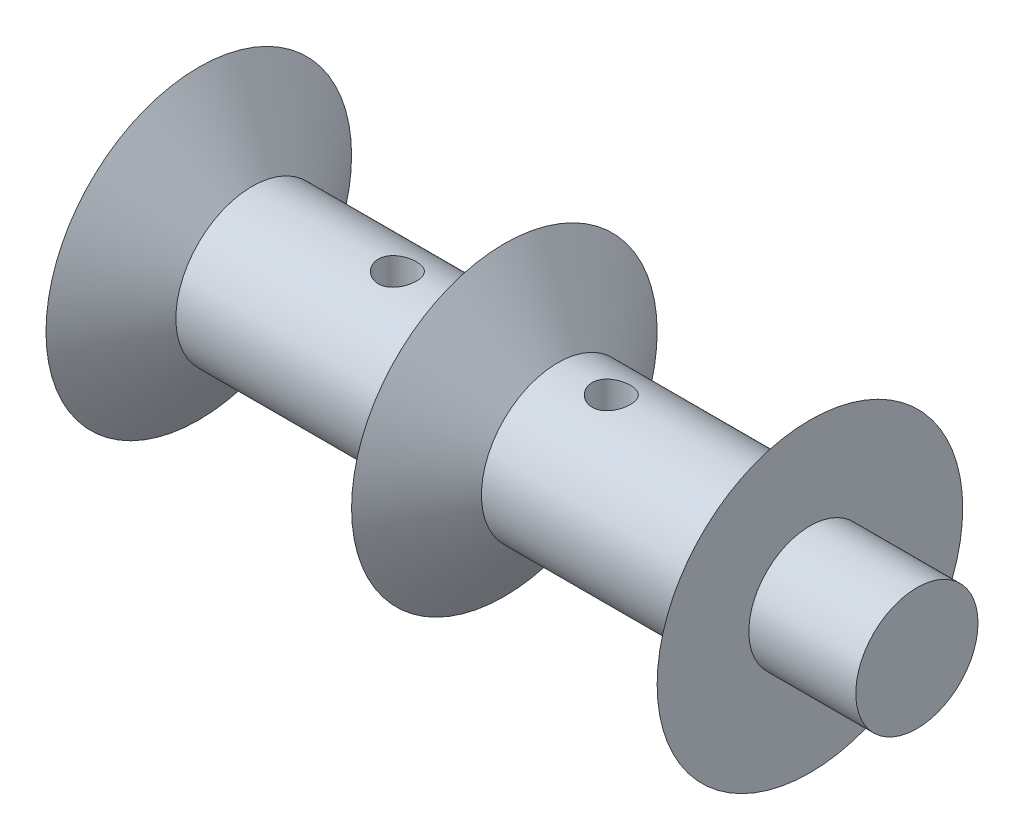
ISO-10303-21;
HEADER;
FILE_DESCRIPTION(('STEP AP214'),'2;1');
FILE_NAME('part.step','',(''),(''),'','','');
FILE_SCHEMA(('AUTOMOTIVE_DESIGN { 1 0 10303 214 1 1 1 1 }'));
ENDSEC;
DATA;
#1=APPLICATION_CONTEXT('core data for automotive mechanical design processes');
#2=APPLICATION_PROTOCOL_DEFINITION('international standard','automotive_design',2000,#1);
#3=PRODUCT_CONTEXT('',#1,'mechanical');
#4=PRODUCT('Part','Part','',(#3));
#5=PRODUCT_RELATED_PRODUCT_CATEGORY('part','',(#4));
#6=PRODUCT_DEFINITION_FORMATION('','',#4);
#7=PRODUCT_DEFINITION_CONTEXT('part definition',#1,'design');
#8=PRODUCT_DEFINITION('design','',#6,#7);
#9=PRODUCT_DEFINITION_SHAPE('','',#8);
#10=(LENGTH_UNIT() NAMED_UNIT(*) SI_UNIT(.MILLI.,.METRE.));
#11=(NAMED_UNIT(*) PLANE_ANGLE_UNIT() SI_UNIT($,.RADIAN.));
#12=(NAMED_UNIT(*) SI_UNIT($,.STERADIAN.) SOLID_ANGLE_UNIT());
#13=UNCERTAINTY_MEASURE_WITH_UNIT(LENGTH_MEASURE(1.E-05),#10,'distance_accuracy_value','');
#14=(GEOMETRIC_REPRESENTATION_CONTEXT(3) GLOBAL_UNCERTAINTY_ASSIGNED_CONTEXT((#13)) GLOBAL_UNIT_ASSIGNED_CONTEXT((#10,
#11,#12)) REPRESENTATION_CONTEXT('',''));
#15=CARTESIAN_POINT('',(0.,0.,0.));
#16=DIRECTION('',(0.,0.,1.));
#17=DIRECTION('',(1.,0.,0.));
#18=AXIS2_PLACEMENT_3D('',#15,#16,#17);
#19=CARTESIAN_POINT('',(-11.,0.,1.5));
#20=DIRECTION('',(0.,0.,-1.));
#21=DIRECTION('',(-1.,0.,0.));
#22=AXIS2_PLACEMENT_3D('',#19,#20,#21);
#23=PLANE('',#22);
#24=DIRECTION('',(-1.,0.,0.));
#25=VECTOR('',#24,1.);
#26=CARTESIAN_POINT('',(-11.,-2.,1.5));
#27=LINE('',#26,#25);
#28=CARTESIAN_POINT('',(-11.,-2.,1.5));
#29=VERTEX_POINT('',#28);
#30=CARTESIAN_POINT('',(-17.5,-2.,1.5));
#31=VERTEX_POINT('',#30);
#32=EDGE_CURVE('E110',#29,#31,#27,.T.);
#33=ORIENTED_EDGE('',*,*,#32,.T.);
#34=DIRECTION('',(0.,1.,0.));
#35=VECTOR('',#34,1.);
#36=CARTESIAN_POINT('',(-17.5,0.,1.5));
#37=LINE('',#36,#35);
#38=CARTESIAN_POINT('',(-17.5,2.,1.5));
#39=VERTEX_POINT('',#38);
#40=EDGE_CURVE('E94',#31,#39,#37,.T.);
#41=ORIENTED_EDGE('',*,*,#40,.T.);
#42=DIRECTION('',(-1.,0.,0.));
#43=VECTOR('',#42,1.);
#44=CARTESIAN_POINT('',(-11.,2.,1.5));
#45=LINE('',#44,#43);
#46=CARTESIAN_POINT('',(-11.,2.,1.5));
#47=VERTEX_POINT('',#46);
#48=EDGE_CURVE('E108',#47,#39,#45,.T.);
#49=ORIENTED_EDGE('',*,*,#48,.F.);
#50=DIRECTION('',(0.,-1.,0.));
#51=VECTOR('',#50,1.);
#52=CARTESIAN_POINT('',(-11.,0.,1.5));
#53=LINE('',#52,#51);
#54=EDGE_CURVE('E235',#47,#29,#53,.T.);
#55=ORIENTED_EDGE('',*,*,#54,.T.);
#56=EDGE_LOOP('',(#33,#41,#49,#55));
#57=FACE_BOUND('',#56,.T.);
#58=ADVANCED_FACE('F45',(#57),#23,.T.);
#59=CARTESIAN_POINT('',(-11.,0.,-1.5));
#60=DIRECTION('',(0.,0.,-1.));
#61=DIRECTION('',(-1.,0.,0.));
#62=AXIS2_PLACEMENT_3D('',#59,#60,#61);
#63=PLANE('',#62);
#64=DIRECTION('',(0.,1.,0.));
#65=VECTOR('',#64,1.);
#66=CARTESIAN_POINT('',(-17.5,0.,-1.5));
#67=LINE('',#66,#65);
#68=CARTESIAN_POINT('',(-17.5,-2.,-1.5));
#69=VERTEX_POINT('',#68);
#70=CARTESIAN_POINT('',(-17.5,2.,-1.5));
#71=VERTEX_POINT('',#70);
#72=EDGE_CURVE('E89',#69,#71,#67,.T.);
#73=ORIENTED_EDGE('',*,*,#72,.F.);
#74=DIRECTION('',(-1.,0.,0.));
#75=VECTOR('',#74,1.);
#76=CARTESIAN_POINT('',(-11.,-2.,-1.5));
#77=LINE('',#76,#75);
#78=CARTESIAN_POINT('',(-11.,-2.,-1.5));
#79=VERTEX_POINT('',#78);
#80=EDGE_CURVE('E102',#79,#69,#77,.T.);
#81=ORIENTED_EDGE('',*,*,#80,.F.);
#82=DIRECTION('',(0.,-1.,0.));
#83=VECTOR('',#82,1.);
#84=CARTESIAN_POINT('',(-11.,0.,-1.5));
#85=LINE('',#84,#83);
#86=CARTESIAN_POINT('',(-11.,2.,-1.5));
#87=VERTEX_POINT('',#86);
#88=EDGE_CURVE('E106',#87,#79,#85,.T.);
#89=ORIENTED_EDGE('',*,*,#88,.F.);
#90=DIRECTION('',(-1.,0.,0.));
#91=VECTOR('',#90,1.);
#92=CARTESIAN_POINT('',(-11.,2.,-1.5));
#93=LINE('',#92,#91);
#94=EDGE_CURVE('E99',#87,#71,#93,.T.);
#95=ORIENTED_EDGE('',*,*,#94,.T.);
#96=EDGE_LOOP('',(#73,#81,#89,#95));
#97=FACE_BOUND('',#96,.T.);
#98=ADVANCED_FACE('F104',(#97),#63,.F.);
#99=CARTESIAN_POINT('',(-20.,9.99999999999999,0.));
#100=DIRECTION('',(-1.,0.,0.));
#101=DIRECTION('',(0.,0.,1.));
#102=AXIS2_PLACEMENT_3D('',#99,#100,#101);
#103=PLANE('',#102);
#104=CARTESIAN_POINT('',(-20.,0.,0.));
#105=DIRECTION('',(-1.,0.,0.));
#106=DIRECTION('',(0.,0.,1.));
#107=AXIS2_PLACEMENT_3D('',#104,#105,#106);
#108=CIRCLE('',#107,2.5);
#109=CARTESIAN_POINT('',(-20.,0.,2.5));
#110=VERTEX_POINT('',#109);
#111=EDGE_CURVE('E234',#110,#110,#108,.T.);
#112=ORIENTED_EDGE('',*,*,#111,.F.);
#113=EDGE_LOOP('',(#112));
#114=FACE_BOUND('',#113,.T.);
#115=CARTESIAN_POINT('',(-20.,0.,0.));
#116=DIRECTION('',(1.,0.,0.));
#117=DIRECTION('',(0.,0.,-1.));
#118=AXIS2_PLACEMENT_3D('',#115,#116,#117);
#119=CIRCLE('',#118,10.);
#120=CARTESIAN_POINT('',(-20.,0.,-10.));
#121=VERTEX_POINT('',#120);
#122=EDGE_CURVE('E120',#121,#121,#119,.T.);
#123=ORIENTED_EDGE('',*,*,#122,.F.);
#124=EDGE_LOOP('',(#123));
#125=FACE_BOUND('',#124,.T.);
#126=ADVANCED_FACE('F180',(#114,#125),#103,.T.);
#127=CARTESIAN_POINT('',(20.,0.,0.));
#128=DIRECTION('',(1.,0.,0.));
#129=DIRECTION('',(0.,0.,-1.));
#130=AXIS2_PLACEMENT_3D('',#127,#128,#129);
#131=CYLINDRICAL_SURFACE('',#130,5.);
#132=CARTESIAN_POINT('',(-7.,-4.84122918275927,1.25));
#133=CARTESIAN_POINT('',(-7.0690253754623,-4.84123050042654,1.24999803929589));
#134=CARTESIAN_POINT('',(-7.138072449339,-4.84272153006957,1.24426312274865));
#135=CARTESIAN_POINT('',(-7.27418378908702,-4.84850930996624,1.22151156273207));
#136=CARTESIAN_POINT('',(-7.34124687723416,-4.85280769310907,1.2044883533711));
#137=CARTESIAN_POINT('',(-7.47140176909352,-4.86369362297984,1.15974559981597));
#138=CARTESIAN_POINT('',(-7.53449857769283,-4.87027821345204,1.13203986392723));
#139=CARTESIAN_POINT('',(-7.65515542626996,-4.88499096014404,1.0667605706307));
#140=CARTESIAN_POINT('',(-7.71271523104011,-4.89311918189251,1.02918659428035));
#141=CARTESIAN_POINT('',(-7.8219308226311,-4.91020358177806,0.944354213655937));
#142=CARTESIAN_POINT('',(-7.87344680017502,-4.91917298811515,0.896918443852024));
#143=CARTESIAN_POINT('',(-7.96788069718017,-4.93681437757649,0.794091032050333));
#144=CARTESIAN_POINT('',(-8.01079781281087,-4.94548633283195,0.738698647090154));
#145=CARTESIAN_POINT('',(-8.08738773381564,-4.96170207760291,0.620572600539477));
#146=CARTESIAN_POINT('',(-8.12092319408073,-4.96922843700296,0.55774728809756));
#147=CARTESIAN_POINT('',(-8.17690482207654,-4.98215405962992,0.427131592146381));
#148=CARTESIAN_POINT('',(-8.19935262595776,-4.98755363667172,0.35934194289597));
#149=CARTESIAN_POINT('',(-8.23207391728929,-4.9955237942409,0.22217937937708));
#150=CARTESIAN_POINT('',(-8.24258482216329,-4.99814946922157,0.152866359774487));
#151=CARTESIAN_POINT('',(-8.25187918963778,-5.00046797053649,0.0134144096313842));
#152=CARTESIAN_POINT('',(-8.2506643861048,-5.00016123048352,-0.0567243972690347));
#153=CARTESIAN_POINT('',(-8.23671257487493,-4.99669047476767,-0.194190308965485));
#154=CARTESIAN_POINT('',(-8.22423183747307,-4.99359001170437,-0.261545269501334));
#155=CARTESIAN_POINT('',(-8.18851436497575,-4.98495418262427,-0.393172809267108));
#156=CARTESIAN_POINT('',(-8.16527705731129,-4.9794186869922,-0.457445224213048));
#157=CARTESIAN_POINT('',(-8.10849871465647,-4.96643754850448,-0.581758379377259));
#158=CARTESIAN_POINT('',(-8.07486647766912,-4.95897509847527,-0.641755637208131));
#159=CARTESIAN_POINT('',(-7.99832216044187,-4.94294951904825,-0.755344527925612));
#160=CARTESIAN_POINT('',(-7.95540846571969,-4.93438619826245,-0.808935043856882));
#161=CARTESIAN_POINT('',(-7.86014562900881,-4.9168185688476,-0.909717543856195));
#162=CARTESIAN_POINT('',(-7.80757255382611,-4.90780859762959,-0.956697098843999));
#163=CARTESIAN_POINT('',(-7.69520001322987,-4.89057521758353,-1.04122046995377));
#164=CARTESIAN_POINT('',(-7.6354002102545,-4.88235184552985,-1.07876384505752));
#165=CARTESIAN_POINT('',(-7.50985498292552,-4.86760248415824,-1.14348516127825));
#166=CARTESIAN_POINT('',(-7.4440821348434,-4.8610849186286,-1.17061195871311));
#167=CARTESIAN_POINT('',(-7.30870726596177,-4.85059320069979,-1.21335702579542));
#168=CARTESIAN_POINT('',(-7.23910606800843,-4.84661850405109,-1.22897775819114));
#169=CARTESIAN_POINT('',(-7.10002024923844,-4.8417767801957,-1.24791481933259));
#170=CARTESIAN_POINT('',(-7.03058110333519,-4.84083044546824,-1.25154523695981));
#171=CARTESIAN_POINT('',(-6.89208903171092,-4.8419367174052,-1.24725849525777));
#172=CARTESIAN_POINT('',(-6.82303607102438,-4.84398904800633,-1.2393423989244));
#173=CARTESIAN_POINT('',(-6.68844286752265,-4.8507854097728,-1.21246273196883));
#174=CARTESIAN_POINT('',(-6.62286363671458,-4.85548485117188,-1.19368203414087));
#175=CARTESIAN_POINT('',(-6.49578427107416,-4.86700359135481,-1.14580904083531));
#176=CARTESIAN_POINT('',(-6.43428462047233,-4.87382314124307,-1.11671552385627));
#177=CARTESIAN_POINT('',(-6.31577936106633,-4.88898068546631,-1.04838533396828));
#178=CARTESIAN_POINT('',(-6.25888557997845,-4.89734584303321,-1.00896087691781));
#179=CARTESIAN_POINT('',(-6.15240581859932,-4.91458541535858,-0.921325366168069));
#180=CARTESIAN_POINT('',(-6.10282104167496,-4.92345991364235,-0.873112868506799));
#181=CARTESIAN_POINT('',(-6.01109447871452,-4.94098701515803,-0.767828401230907));
#182=CARTESIAN_POINT('',(-5.96916996872559,-4.94962851030918,-0.71056494066449));
#183=CARTESIAN_POINT('',(-5.89553206652438,-4.96548608306867,-0.589628353368344));
#184=CARTESIAN_POINT('',(-5.8638181416959,-4.9727022350198,-0.525955561196988));
#185=CARTESIAN_POINT('',(-5.81177698273603,-4.98485057869157,-0.394447752163862));
#186=CARTESIAN_POINT('',(-5.79136785781047,-4.98979915011205,-0.326646726284851));
#187=CARTESIAN_POINT('',(-5.76226983269579,-4.99692646697894,-0.18843720039851));
#188=CARTESIAN_POINT('',(-5.75357867063047,-4.99910574696704,-0.118029206301554));
#189=CARTESIAN_POINT('',(-5.74829051303058,-5.00042711761014,0.021354408054158));
#190=CARTESIAN_POINT('',(-5.75137286363076,-4.99964973600011,0.0903172837075413));
#191=CARTESIAN_POINT('',(-5.76880978411792,-4.9953237057178,0.226709370518424));
#192=CARTESIAN_POINT('',(-5.78316401876638,-4.99177513946369,0.294138627226108));
#193=CARTESIAN_POINT('',(-5.82256527471366,-4.98231791067453,0.42521379455602));
#194=CARTESIAN_POINT('',(-5.84755431664328,-4.97642205628333,0.488878118226273));
#195=CARTESIAN_POINT('',(-5.90746322377416,-4.9628911114173,0.611146316301835));
#196=CARTESIAN_POINT('',(-5.94238434083696,-4.9552558017217,0.669749551581314));
#197=CARTESIAN_POINT('',(-6.02214404249634,-4.93884062101666,0.781752410529874));
#198=CARTESIAN_POINT('',(-6.06720017863422,-4.93003771182014,0.83499373537573));
#199=CARTESIAN_POINT('',(-6.16552856496725,-4.91238311316553,0.933268775339068));
#200=CARTESIAN_POINT('',(-6.21880289512238,-4.90353141190695,0.978300406335236));
#201=CARTESIAN_POINT('',(-6.33325176775167,-4.88659344825685,1.05970253309904));
#202=CARTESIAN_POINT('',(-6.39455515426578,-4.87852454662356,1.09589577430819));
#203=CARTESIAN_POINT('',(-6.52256936240338,-4.8642994443827,1.15740862076958));
#204=CARTESIAN_POINT('',(-6.58927620763343,-4.85814185308378,1.18273613719965));
#205=CARTESIAN_POINT('',(-6.7132212647834,-4.84939885924729,1.2180281607068));
#206=CARTESIAN_POINT('',(-6.76986645547983,-4.84635828750683,1.22999146324422));
#207=CARTESIAN_POINT('',(-6.88433608624995,-4.84227298231965,1.24597786571659));
#208=CARTESIAN_POINT('',(-6.94216042530633,-4.84122807862454,1.25000164296523));
#209=CARTESIAN_POINT('',(-7.,-4.84122918275927,1.25));
#210=B_SPLINE_CURVE_WITH_KNOTS('',3,(#132,#133,#134,#135,#136,#137,#138,#139,#140,#141,#142,
#143,#144,#145,#146,#147,#148,#149,#150,#151,#152,#153,#154,#155,#156,#157,#158,#159,#160,#161,
#162,#163,#164,#165,#166,#167,#168,#169,#170,#171,#172,#173,#174,#175,#176,#177,#178,#179,#180,
#181,#182,#183,#184,#185,#186,#187,#188,#189,#190,#191,#192,#193,#194,#195,#196,#197,#198,#199,
#200,#201,#202,#203,#204,#205,#206,#207,#208,#209),.UNSPECIFIED.,.T.,.F.,(4,2,2,2,2,2,2,2,2,2,2,
2,2,2,2,2,2,2,2,2,2,2,2,2,2,2,2,2,2,2,2,2,2,2,2,2,2,2,4),(0.,0.206863720868067,
0.413847870714333,0.620565363583009,0.827291633777392,1.03811977096488,1.24896760739933,
1.4627574819896,1.67651579923546,1.88594375497673,2.0953407433301,2.30009131344473,
2.50485278362393,2.71146437127222,2.91811192734456,3.13035233285956,3.34260265599901,
3.55588216004201,3.76911600064774,3.97671787380858,4.18430063591901,4.38848702504603,
4.59269760710709,4.80091422929578,5.00916509442522,5.22262665482659,5.43607707859776,
5.64796036403464,5.85980274454519,6.06591723063728,6.2720255868849,6.47702438279855,
6.68204902869036,6.89198548291035,7.10197515782754,7.31588238642338,7.52963360683309,
7.70298913588665,7.8763298754976),.UNSPECIFIED.);
#211=CARTESIAN_POINT('',(-7.,-4.84122918275927,1.25));
#212=VERTEX_POINT('',#211);
#213=EDGE_CURVE('E50',#212,#212,#210,.T.);
#214=ORIENTED_EDGE('',*,*,#213,.F.);
#215=EDGE_LOOP('',(#214));
#216=FACE_BOUND('',#215,.T.);
#217=CARTESIAN_POINT('',(-7.,4.84122918275927,1.25));
#218=CARTESIAN_POINT('',(-6.9309746245377,4.84123050042654,1.24999803929589));
#219=CARTESIAN_POINT('',(-6.861927550661,4.84272153006956,1.24426312274865));
#220=CARTESIAN_POINT('',(-6.72581621091298,4.84850930996624,1.22151156273207));
#221=CARTESIAN_POINT('',(-6.65875312276584,4.85280769310906,1.2044883533711));
#222=CARTESIAN_POINT('',(-6.52859823090648,4.86369362297983,1.15974559981597));
#223=CARTESIAN_POINT('',(-6.46550142230716,4.87027821345204,1.13203986392723));
#224=CARTESIAN_POINT('',(-6.34484457373004,4.88499096014403,1.0667605706307));
#225=CARTESIAN_POINT('',(-6.28728476895989,4.89311918189251,1.02918659428035));
#226=CARTESIAN_POINT('',(-6.1780691773689,4.91020358177805,0.944354213655937));
#227=CARTESIAN_POINT('',(-6.12655319982498,4.91917298811515,0.896918443852024));
#228=CARTESIAN_POINT('',(-6.03211930281983,4.93681437757648,0.794091032050331));
#229=CARTESIAN_POINT('',(-5.98920218718913,4.94548633283194,0.738698647090153));
#230=CARTESIAN_POINT('',(-5.91261226618436,4.9617020776029,0.620572600539477));
#231=CARTESIAN_POINT('',(-5.87907680591927,4.96922843700296,0.557747288097559));
#232=CARTESIAN_POINT('',(-5.82309517792346,4.98215405962992,0.42713159214638));
#233=CARTESIAN_POINT('',(-5.80064737404224,4.98755363667172,0.359341942895969));
#234=CARTESIAN_POINT('',(-5.76792608271071,4.9955237942409,0.22217937937708));
#235=CARTESIAN_POINT('',(-5.75741517783671,4.99814946922157,0.152866359774487));
#236=CARTESIAN_POINT('',(-5.74812081036222,5.00046797053648,0.0134144096313844));
#237=CARTESIAN_POINT('',(-5.7493356138952,5.00016123048351,-0.0567243972690343));
#238=CARTESIAN_POINT('',(-5.76328742512507,4.99669047476767,-0.194190308965484));
#239=CARTESIAN_POINT('',(-5.77576816252693,4.99359001170437,-0.261545269501334));
#240=CARTESIAN_POINT('',(-5.81148563502425,4.98495418262427,-0.393172809267108));
#241=CARTESIAN_POINT('',(-5.83472294268871,4.9794186869922,-0.457445224213047));
#242=CARTESIAN_POINT('',(-5.89150128534353,4.96643754850447,-0.581758379377258));
#243=CARTESIAN_POINT('',(-5.92513352233087,4.95897509847526,-0.64175563720813));
#244=CARTESIAN_POINT('',(-6.00167783955813,4.94294951904824,-0.75534452792561));
#245=CARTESIAN_POINT('',(-6.04459153428031,4.93438619826245,-0.808935043856881));
#246=CARTESIAN_POINT('',(-6.13985437099119,4.9168185688476,-0.909717543856195));
#247=CARTESIAN_POINT('',(-6.19242744617389,4.90780859762958,-0.956697098843998));
#248=CARTESIAN_POINT('',(-6.30479998677013,4.89057521758353,-1.04122046995377));
#249=CARTESIAN_POINT('',(-6.3645997897455,4.88235184552985,-1.07876384505752));
#250=CARTESIAN_POINT('',(-6.49014501707448,4.86760248415824,-1.14348516127825));
#251=CARTESIAN_POINT('',(-6.5559178651566,4.8610849186286,-1.17061195871311));
#252=CARTESIAN_POINT('',(-6.69129273403823,4.85059320069978,-1.21335702579542));
#253=CARTESIAN_POINT('',(-6.76089393199157,4.84661850405109,-1.22897775819114));
#254=CARTESIAN_POINT('',(-6.89997975076156,4.8417767801957,-1.24791481933259));
#255=CARTESIAN_POINT('',(-6.96941889666481,4.84083044546824,-1.25154523695981));
#256=CARTESIAN_POINT('',(-7.10791096828908,4.84193671740519,-1.24725849525777));
#257=CARTESIAN_POINT('',(-7.17696392897562,4.84398904800633,-1.2393423989244));
#258=CARTESIAN_POINT('',(-7.31155713247735,4.8507854097728,-1.21246273196883));
#259=CARTESIAN_POINT('',(-7.37713636328542,4.85548485117187,-1.19368203414087));
#260=CARTESIAN_POINT('',(-7.50421572892584,4.86700359135481,-1.14580904083531));
#261=CARTESIAN_POINT('',(-7.56571537952767,4.87382314124306,-1.11671552385627));
#262=CARTESIAN_POINT('',(-7.68422063893368,4.88898068546631,-1.04838533396828));
#263=CARTESIAN_POINT('',(-7.74111442002155,4.8973458430332,-1.00896087691781));
#264=CARTESIAN_POINT('',(-7.84759418140068,4.91458541535858,-0.921325366168069));
#265=CARTESIAN_POINT('',(-7.89717895832504,4.92345991364235,-0.873112868506799));
#266=CARTESIAN_POINT('',(-7.98890552128548,4.94098701515803,-0.767828401230908));
#267=CARTESIAN_POINT('',(-8.03083003127441,4.94962851030917,-0.710564940664491));
#268=CARTESIAN_POINT('',(-8.10446793347562,4.96548608306867,-0.589628353368345));
#269=CARTESIAN_POINT('',(-8.1361818583041,4.9727022350198,-0.525955561196989));
#270=CARTESIAN_POINT('',(-8.18822301726396,4.98485057869156,-0.394447752163862));
#271=CARTESIAN_POINT('',(-8.20863214218953,4.98979915011205,-0.326646726284851));
#272=CARTESIAN_POINT('',(-8.23773016730421,4.99692646697894,-0.188437200398509));
#273=CARTESIAN_POINT('',(-8.24642132936953,4.99910574696704,-0.118029206301554));
#274=CARTESIAN_POINT('',(-8.25170948696942,5.00042711761014,0.0213544080541583));
#275=CARTESIAN_POINT('',(-8.24862713636924,4.9996497360001,0.0903172837075416));
#276=CARTESIAN_POINT('',(-8.23119021588208,4.99532370571779,0.226709370518425));
#277=CARTESIAN_POINT('',(-8.21683598123362,4.99177513946368,0.294138627226109));
#278=CARTESIAN_POINT('',(-8.17743472528634,4.98231791067453,0.42521379455602));
#279=CARTESIAN_POINT('',(-8.15244568335672,4.97642205628332,0.488878118226273));
#280=CARTESIAN_POINT('',(-8.09253677622584,4.9628911114173,0.611146316301835));
#281=CARTESIAN_POINT('',(-8.05761565916304,4.9552558017217,0.669749551581314));
#282=CARTESIAN_POINT('',(-7.97785595750366,4.93884062101666,0.781752410529874));
#283=CARTESIAN_POINT('',(-7.93279982136578,4.93003771182014,0.834993735375731));
#284=CARTESIAN_POINT('',(-7.83447143503275,4.91238311316552,0.933268775339069));
#285=CARTESIAN_POINT('',(-7.78119710487762,4.90353141190694,0.978300406335236));
#286=CARTESIAN_POINT('',(-7.66674823224833,4.88659344825685,1.05970253309903));
#287=CARTESIAN_POINT('',(-7.60544484573422,4.87852454662355,1.09589577430819));
#288=CARTESIAN_POINT('',(-7.47743063759662,4.86429944438269,1.15740862076958));
#289=CARTESIAN_POINT('',(-7.41072379236657,4.85814185308378,1.18273613719965));
#290=CARTESIAN_POINT('',(-7.2867787352166,4.84939885924729,1.2180281607068));
#291=CARTESIAN_POINT('',(-7.23013354452017,4.84635828750683,1.22999146324422));
#292=CARTESIAN_POINT('',(-7.11566391375005,4.84227298231965,1.24597786571659));
#293=CARTESIAN_POINT('',(-7.05783957469367,4.84122807862453,1.25000164296523));
#294=CARTESIAN_POINT('',(-7.,4.84122918275927,1.25));
#295=B_SPLINE_CURVE_WITH_KNOTS('',3,(#217,#218,#219,#220,#221,#222,#223,#224,#225,#226,#227,
#228,#229,#230,#231,#232,#233,#234,#235,#236,#237,#238,#239,#240,#241,#242,#243,#244,#245,#246,
#247,#248,#249,#250,#251,#252,#253,#254,#255,#256,#257,#258,#259,#260,#261,#262,#263,#264,#265,
#266,#267,#268,#269,#270,#271,#272,#273,#274,#275,#276,#277,#278,#279,#280,#281,#282,#283,#284,
#285,#286,#287,#288,#289,#290,#291,#292,#293,#294),.UNSPECIFIED.,.T.,.F.,(4,2,2,2,2,2,2,2,2,2,2,
2,2,2,2,2,2,2,2,2,2,2,2,2,2,2,2,2,2,2,2,2,2,2,2,2,2,2,4),(0.,0.206863720868067,
0.413847870714333,0.620565363583011,0.827291633777392,1.03811977096488,1.24896760739933,
1.4627574819896,1.67651579923546,1.88594375497673,2.0953407433301,2.30009131344473,
2.50485278362393,2.71146437127222,2.91811192734456,3.13035233285956,3.34260265599901,
3.55588216004201,3.76911600064773,3.97671787380858,4.18430063591901,4.38848702504603,
4.59269760710709,4.80091422929578,5.00916509442522,5.22262665482659,5.43607707859776,
5.64796036403464,5.85980274454519,6.06591723063728,6.2720255868849,6.47702438279855,
6.68204902869036,6.89198548291035,7.10197515782754,7.31588238642338,7.5296336068331,
7.70298913588665,7.8763298754976),.UNSPECIFIED.);
#296=CARTESIAN_POINT('',(-7.,4.84122918275927,1.25));
#297=VERTEX_POINT('',#296);
#298=EDGE_CURVE('E219',#297,#297,#295,.T.);
#299=ORIENTED_EDGE('',*,*,#298,.F.);
#300=EDGE_LOOP('',(#299));
#301=FACE_BOUND('',#300,.T.);
#302=CARTESIAN_POINT('',(-16.5,0.,0.));
#303=DIRECTION('',(1.,0.,0.));
#304=DIRECTION('',(0.,0.,-1.));
#305=AXIS2_PLACEMENT_3D('',#302,#303,#304);
#306=CIRCLE('',#305,5.);
#307=CARTESIAN_POINT('',(-16.5,0.,-5.));
#308=VERTEX_POINT('',#307);
#309=EDGE_CURVE('E117',#308,#308,#306,.T.);
#310=ORIENTED_EDGE('',*,*,#309,.T.);
#311=EDGE_LOOP('',(#310));
#312=FACE_BOUND('',#311,.T.);
#313=CARTESIAN_POINT('',(-3.5,0.,0.));
#314=DIRECTION('',(1.,0.,0.));
#315=DIRECTION('',(0.,0.,-1.));
#316=AXIS2_PLACEMENT_3D('',#313,#314,#315);
#317=CIRCLE('',#316,5.);
#318=CARTESIAN_POINT('',(-3.5,0.,-5.));
#319=VERTEX_POINT('',#318);
#320=EDGE_CURVE('E58',#319,#319,#317,.T.);
#321=ORIENTED_EDGE('',*,*,#320,.F.);
#322=EDGE_LOOP('',(#321));
#323=FACE_BOUND('',#322,.T.);
#324=ADVANCED_FACE('F47',(#216,#301,#312,#323),#131,.T.);
#325=CARTESIAN_POINT('',(0.,0.,0.));
#326=DIRECTION('',(1.,0.,0.));
#327=DIRECTION('',(0.,0.,-1.));
#328=AXIS2_PLACEMENT_3D('',#325,#326,#327);
#329=CONICAL_SURFACE('',#328,10.,0.960070362405688);
#330=ORIENTED_EDGE('',*,*,#320,.T.);
#331=EDGE_LOOP('',(#330));
#332=FACE_BOUND('',#331,.T.);
#333=CARTESIAN_POINT('',(0.,0.,0.));
#334=DIRECTION('',(1.,0.,0.));
#335=DIRECTION('',(0.,0.,-1.));
#336=AXIS2_PLACEMENT_3D('',#333,#334,#335);
#337=CIRCLE('',#336,10.);
#338=CARTESIAN_POINT('',(0.,0.,-10.));
#339=VERTEX_POINT('',#338);
#340=EDGE_CURVE('E132',#339,#339,#337,.T.);
#341=ORIENTED_EDGE('',*,*,#340,.F.);
#342=EDGE_LOOP('',(#341));
#343=FACE_BOUND('',#342,.T.);
#344=ADVANCED_FACE('F209',(#332,#343),#329,.T.);
#345=CARTESIAN_POINT('',(3.5,0.,0.));
#346=DIRECTION('',(-1.,0.,0.));
#347=DIRECTION('',(0.,0.,1.));
#348=AXIS2_PLACEMENT_3D('',#345,#346,#347);
#349=CONICAL_SURFACE('',#348,5.,0.960070362405687);
#350=ORIENTED_EDGE('',*,*,#340,.T.);
#351=EDGE_LOOP('',(#350));
#352=FACE_BOUND('',#351,.T.);
#353=CARTESIAN_POINT('',(3.5,0.,0.));
#354=DIRECTION('',(1.,0.,0.));
#355=DIRECTION('',(0.,0.,-1.));
#356=AXIS2_PLACEMENT_3D('',#353,#354,#355);
#357=CIRCLE('',#356,5.);
#358=CARTESIAN_POINT('',(3.5,0.,-5.));
#359=VERTEX_POINT('',#358);
#360=EDGE_CURVE('E129',#359,#359,#357,.T.);
#361=ORIENTED_EDGE('',*,*,#360,.F.);
#362=EDGE_LOOP('',(#361));
#363=FACE_BOUND('',#362,.T.);
#364=ADVANCED_FACE('F199',(#352,#363),#349,.T.);
#365=CARTESIAN_POINT('',(20.,0.,0.));
#366=DIRECTION('',(1.,0.,0.));
#367=DIRECTION('',(0.,0.,-1.));
#368=AXIS2_PLACEMENT_3D('',#365,#366,#367);
#369=CYLINDRICAL_SURFACE('',#368,5.);
#370=CARTESIAN_POINT('',(7.,-4.84122918275927,1.25));
#371=CARTESIAN_POINT('',(6.9309746245377,-4.84123050042654,1.24999803929589));
#372=CARTESIAN_POINT('',(6.861927550661,-4.84272153006957,1.24426312274865));
#373=CARTESIAN_POINT('',(6.72581621091298,-4.84850930996624,1.22151156273207));
#374=CARTESIAN_POINT('',(6.65875312276584,-4.85280769310907,1.2044883533711));
#375=CARTESIAN_POINT('',(6.52859823090648,-4.86369362297984,1.15974559981597));
#376=CARTESIAN_POINT('',(6.46550142230716,-4.87027821345205,1.13203986392723));
#377=CARTESIAN_POINT('',(6.34484457373004,-4.88499096014404,1.0667605706307));
#378=CARTESIAN_POINT('',(6.28728476895989,-4.89311918189251,1.02918659428035));
#379=CARTESIAN_POINT('',(6.1780691773689,-4.91020358177806,0.944354213655937));
#380=CARTESIAN_POINT('',(6.12655319982498,-4.91917298811515,0.896918443852024));
#381=CARTESIAN_POINT('',(6.03211930281983,-4.93681437757649,0.794091032050332));
#382=CARTESIAN_POINT('',(5.98920218718913,-4.94548633283195,0.738698647090153));
#383=CARTESIAN_POINT('',(5.91261226618436,-4.96170207760291,0.620572600539477));
#384=CARTESIAN_POINT('',(5.87907680591927,-4.96922843700296,0.55774728809756));
#385=CARTESIAN_POINT('',(5.82309517792346,-4.98215405962992,0.427131592146381));
#386=CARTESIAN_POINT('',(5.80064737404224,-4.98755363667172,0.35934194289597));
#387=CARTESIAN_POINT('',(5.76792608271071,-4.9955237942409,0.222179379377081));
#388=CARTESIAN_POINT('',(5.75741517783671,-4.99814946922157,0.152866359774488));
#389=CARTESIAN_POINT('',(5.74812081036222,-5.00046797053649,0.0134144096313847));
#390=CARTESIAN_POINT('',(5.7493356138952,-5.00016123048352,-0.0567243972690343));
#391=CARTESIAN_POINT('',(5.76328742512507,-4.99669047476767,-0.194190308965484));
#392=CARTESIAN_POINT('',(5.77576816252693,-4.99359001170437,-0.261545269501334));
#393=CARTESIAN_POINT('',(5.81148563502425,-4.98495418262427,-0.393172809267108));
#394=CARTESIAN_POINT('',(5.8347229426887,-4.9794186869922,-0.457445224213048));
#395=CARTESIAN_POINT('',(5.89150128534353,-4.96643754850448,-0.581758379377258));
#396=CARTESIAN_POINT('',(5.92513352233087,-4.95897509847527,-0.641755637208131));
#397=CARTESIAN_POINT('',(6.00167783955813,-4.94294951904825,-0.755344527925611));
#398=CARTESIAN_POINT('',(6.04459153428031,-4.93438619826245,-0.808935043856882));
#399=CARTESIAN_POINT('',(6.13985437099119,-4.9168185688476,-0.909717543856196));
#400=CARTESIAN_POINT('',(6.19242744617389,-4.90780859762959,-0.956697098843999));
#401=CARTESIAN_POINT('',(6.30479998677013,-4.89057521758353,-1.04122046995377));
#402=CARTESIAN_POINT('',(6.3645997897455,-4.88235184552985,-1.07876384505752));
#403=CARTESIAN_POINT('',(6.49014501707448,-4.86760248415824,-1.14348516127825));
#404=CARTESIAN_POINT('',(6.5559178651566,-4.8610849186286,-1.17061195871311));
#405=CARTESIAN_POINT('',(6.69129273403823,-4.85059320069979,-1.21335702579543));
#406=CARTESIAN_POINT('',(6.76089393199157,-4.84661850405109,-1.22897775819114));
#407=CARTESIAN_POINT('',(6.89997975076156,-4.8417767801957,-1.24791481933259));
#408=CARTESIAN_POINT('',(6.96941889666482,-4.84083044546824,-1.25154523695981));
#409=CARTESIAN_POINT('',(7.10791096828908,-4.8419367174052,-1.24725849525777));
#410=CARTESIAN_POINT('',(7.17696392897562,-4.84398904800633,-1.2393423989244));
#411=CARTESIAN_POINT('',(7.31155713247735,-4.8507854097728,-1.21246273196883));
#412=CARTESIAN_POINT('',(7.37713636328542,-4.85548485117188,-1.19368203414087));
#413=CARTESIAN_POINT('',(7.50421572892584,-4.86700359135481,-1.14580904083531));
#414=CARTESIAN_POINT('',(7.56571537952767,-4.87382314124307,-1.11671552385627));
#415=CARTESIAN_POINT('',(7.68422063893368,-4.88898068546631,-1.04838533396828));
#416=CARTESIAN_POINT('',(7.74111442002155,-4.89734584303321,-1.00896087691781));
#417=CARTESIAN_POINT('',(7.84759418140068,-4.91458541535858,-0.921325366168069));
#418=CARTESIAN_POINT('',(7.89717895832504,-4.92345991364235,-0.873112868506799));
#419=CARTESIAN_POINT('',(7.98890552128548,-4.94098701515803,-0.767828401230907));
#420=CARTESIAN_POINT('',(8.03083003127441,-4.94962851030918,-0.71056494066449));
#421=CARTESIAN_POINT('',(8.10446793347562,-4.96548608306867,-0.589628353368344));
#422=CARTESIAN_POINT('',(8.1361818583041,-4.9727022350198,-0.525955561196988));
#423=CARTESIAN_POINT('',(8.18822301726397,-4.98485057869157,-0.394447752163862));
#424=CARTESIAN_POINT('',(8.20863214218953,-4.98979915011205,-0.326646726284851));
#425=CARTESIAN_POINT('',(8.23773016730421,-4.99692646697894,-0.18843720039851));
#426=CARTESIAN_POINT('',(8.24642132936953,-4.99910574696704,-0.118029206301554));
#427=CARTESIAN_POINT('',(8.25170948696942,-5.00042711761014,0.0213544080541583));
#428=CARTESIAN_POINT('',(8.24862713636924,-4.99964973600011,0.0903172837075417));
#429=CARTESIAN_POINT('',(8.23119021588209,-4.9953237057178,0.226709370518425));
#430=CARTESIAN_POINT('',(8.21683598123362,-4.99177513946369,0.294138627226108));
#431=CARTESIAN_POINT('',(8.17743472528634,-4.98231791067453,0.42521379455602));
#432=CARTESIAN_POINT('',(8.15244568335672,-4.97642205628333,0.488878118226274));
#433=CARTESIAN_POINT('',(8.09253677622584,-4.9628911114173,0.611146316301836));
#434=CARTESIAN_POINT('',(8.05761565916304,-4.9552558017217,0.669749551581314));
#435=CARTESIAN_POINT('',(7.97785595750366,-4.93884062101666,0.781752410529874));
#436=CARTESIAN_POINT('',(7.93279982136578,-4.93003771182014,0.83499373537573));
#437=CARTESIAN_POINT('',(7.83447143503275,-4.91238311316553,0.933268775339068));
#438=CARTESIAN_POINT('',(7.78119710487762,-4.90353141190695,0.978300406335236));
#439=CARTESIAN_POINT('',(7.66674823224834,-4.88659344825685,1.05970253309904));
#440=CARTESIAN_POINT('',(7.60544484573422,-4.87852454662356,1.09589577430819));
#441=CARTESIAN_POINT('',(7.47743063759662,-4.8642994443827,1.15740862076958));
#442=CARTESIAN_POINT('',(7.41072379236657,-4.85814185308378,1.18273613719965));
#443=CARTESIAN_POINT('',(7.2867787352166,-4.84939885924729,1.2180281607068));
#444=CARTESIAN_POINT('',(7.23013354452017,-4.84635828750683,1.22999146324422));
#445=CARTESIAN_POINT('',(7.11566391375005,-4.84227298231965,1.24597786571659));
#446=CARTESIAN_POINT('',(7.05783957469367,-4.84122807862454,1.25000164296523));
#447=CARTESIAN_POINT('',(7.,-4.84122918275927,1.25));
#448=B_SPLINE_CURVE_WITH_KNOTS('',3,(#370,#371,#372,#373,#374,#375,#376,#377,#378,#379,#380,
#381,#382,#383,#384,#385,#386,#387,#388,#389,#390,#391,#392,#393,#394,#395,#396,#397,#398,#399,
#400,#401,#402,#403,#404,#405,#406,#407,#408,#409,#410,#411,#412,#413,#414,#415,#416,#417,#418,
#419,#420,#421,#422,#423,#424,#425,#426,#427,#428,#429,#430,#431,#432,#433,#434,#435,#436,#437,
#438,#439,#440,#441,#442,#443,#444,#445,#446,#447),.UNSPECIFIED.,.T.,.F.,(4,2,2,2,2,2,2,2,2,2,2,
2,2,2,2,2,2,2,2,2,2,2,2,2,2,2,2,2,2,2,2,2,2,2,2,2,2,2,4),(0.,0.206863720868068,
0.413847870714333,0.620565363583011,0.827291633777393,1.03811977096488,1.24896760739933,
1.4627574819896,1.67651579923546,1.88594375497673,2.0953407433301,2.30009131344474,
2.50485278362393,2.71146437127222,2.91811192734457,3.13035233285956,3.34260265599901,
3.55588216004201,3.76911600064774,3.97671787380859,4.18430063591901,4.38848702504604,
4.59269760710709,4.80091422929579,5.00916509442522,5.2226266548266,5.43607707859777,
5.64796036403465,5.85980274454519,6.06591723063728,6.27202558688491,6.47702438279856,
6.68204902869036,6.89198548291035,7.10197515782755,7.31588238642339,7.5296336068331,
7.70298913588665,7.8763298754976),.UNSPECIFIED.);
#449=CARTESIAN_POINT('',(7.,-4.84122918275927,1.25));
#450=VERTEX_POINT('',#449);
#451=EDGE_CURVE('E144',#450,#450,#448,.T.);
#452=ORIENTED_EDGE('',*,*,#451,.F.);
#453=EDGE_LOOP('',(#452));
#454=FACE_BOUND('',#453,.T.);
#455=CARTESIAN_POINT('',(7.,4.84122918275927,1.25));
#456=CARTESIAN_POINT('',(7.0690253754623,4.84123050042654,1.24999803929589));
#457=CARTESIAN_POINT('',(7.138072449339,4.84272153006956,1.24426312274865));
#458=CARTESIAN_POINT('',(7.27418378908702,4.84850930996624,1.22151156273207));
#459=CARTESIAN_POINT('',(7.34124687723416,4.85280769310906,1.2044883533711));
#460=CARTESIAN_POINT('',(7.47140176909352,4.86369362297983,1.15974559981597));
#461=CARTESIAN_POINT('',(7.53449857769284,4.87027821345204,1.13203986392723));
#462=CARTESIAN_POINT('',(7.65515542626996,4.88499096014403,1.0667605706307));
#463=CARTESIAN_POINT('',(7.71271523104011,4.89311918189251,1.02918659428035));
#464=CARTESIAN_POINT('',(7.8219308226311,4.91020358177805,0.944354213655937));
#465=CARTESIAN_POINT('',(7.87344680017502,4.91917298811515,0.896918443852025));
#466=CARTESIAN_POINT('',(7.96788069718017,4.93681437757648,0.794091032050333));
#467=CARTESIAN_POINT('',(8.01079781281087,4.94548633283194,0.738698647090155));
#468=CARTESIAN_POINT('',(8.08738773381564,4.9617020776029,0.620572600539478));
#469=CARTESIAN_POINT('',(8.12092319408073,4.96922843700296,0.55774728809756));
#470=CARTESIAN_POINT('',(8.17690482207654,4.98215405962992,0.427131592146381));
#471=CARTESIAN_POINT('',(8.19935262595776,4.98755363667172,0.35934194289597));
#472=CARTESIAN_POINT('',(8.23207391728929,4.9955237942409,0.22217937937708));
#473=CARTESIAN_POINT('',(8.24258482216329,4.99814946922157,0.152866359774487));
#474=CARTESIAN_POINT('',(8.25187918963778,5.00046797053648,0.0134144096313843));
#475=CARTESIAN_POINT('',(8.2506643861048,5.00016123048351,-0.0567243972690346));
#476=CARTESIAN_POINT('',(8.23671257487493,4.99669047476767,-0.194190308965484));
#477=CARTESIAN_POINT('',(8.22423183747307,4.99359001170437,-0.261545269501334));
#478=CARTESIAN_POINT('',(8.18851436497575,4.98495418262427,-0.393172809267108));
#479=CARTESIAN_POINT('',(8.16527705731129,4.9794186869922,-0.457445224213048));
#480=CARTESIAN_POINT('',(8.10849871465647,4.96643754850447,-0.581758379377259));
#481=CARTESIAN_POINT('',(8.07486647766913,4.95897509847526,-0.641755637208131));
#482=CARTESIAN_POINT('',(7.99832216044187,4.94294951904824,-0.755344527925611));
#483=CARTESIAN_POINT('',(7.95540846571969,4.93438619826245,-0.808935043856882));
#484=CARTESIAN_POINT('',(7.86014562900881,4.9168185688476,-0.909717543856195));
#485=CARTESIAN_POINT('',(7.80757255382611,4.90780859762958,-0.956697098843999));
#486=CARTESIAN_POINT('',(7.69520001322987,4.89057521758353,-1.04122046995377));
#487=CARTESIAN_POINT('',(7.6354002102545,4.88235184552985,-1.07876384505752));
#488=CARTESIAN_POINT('',(7.50985498292552,4.86760248415824,-1.14348516127825));
#489=CARTESIAN_POINT('',(7.4440821348434,4.8610849186286,-1.17061195871311));
#490=CARTESIAN_POINT('',(7.30870726596177,4.85059320069978,-1.21335702579543));
#491=CARTESIAN_POINT('',(7.23910606800843,4.84661850405109,-1.22897775819114));
#492=CARTESIAN_POINT('',(7.10002024923844,4.8417767801957,-1.24791481933259));
#493=CARTESIAN_POINT('',(7.03058110333519,4.84083044546824,-1.25154523695981));
#494=CARTESIAN_POINT('',(6.89208903171092,4.84193671740519,-1.24725849525777));
#495=CARTESIAN_POINT('',(6.82303607102438,4.84398904800633,-1.2393423989244));
#496=CARTESIAN_POINT('',(6.68844286752265,4.8507854097728,-1.21246273196883));
#497=CARTESIAN_POINT('',(6.62286363671458,4.85548485117187,-1.19368203414087));
#498=CARTESIAN_POINT('',(6.49578427107416,4.86700359135481,-1.14580904083531));
#499=CARTESIAN_POINT('',(6.43428462047233,4.87382314124306,-1.11671552385627));
#500=CARTESIAN_POINT('',(6.31577936106633,4.88898068546631,-1.04838533396828));
#501=CARTESIAN_POINT('',(6.25888557997845,4.8973458430332,-1.00896087691781));
#502=CARTESIAN_POINT('',(6.15240581859932,4.91458541535857,-0.92132536616807));
#503=CARTESIAN_POINT('',(6.10282104167496,4.92345991364235,-0.8731128685068));
#504=CARTESIAN_POINT('',(6.01109447871452,4.94098701515803,-0.767828401230907));
#505=CARTESIAN_POINT('',(5.96916996872559,4.94962851030917,-0.710564940664491));
#506=CARTESIAN_POINT('',(5.89553206652438,4.96548608306867,-0.589628353368344));
#507=CARTESIAN_POINT('',(5.8638181416959,4.9727022350198,-0.525955561196989));
#508=CARTESIAN_POINT('',(5.81177698273603,4.98485057869156,-0.394447752163863));
#509=CARTESIAN_POINT('',(5.79136785781047,4.98979915011205,-0.326646726284852));
#510=CARTESIAN_POINT('',(5.76226983269579,4.99692646697894,-0.18843720039851));
#511=CARTESIAN_POINT('',(5.75357867063048,4.99910574696704,-0.118029206301555));
#512=CARTESIAN_POINT('',(5.74829051303058,5.00042711761014,0.0213544080541579));
#513=CARTESIAN_POINT('',(5.75137286363076,4.9996497360001,0.0903172837075413));
#514=CARTESIAN_POINT('',(5.76880978411791,4.99532370571779,0.226709370518424));
#515=CARTESIAN_POINT('',(5.78316401876638,4.99177513946368,0.294138627226108));
#516=CARTESIAN_POINT('',(5.82256527471366,4.98231791067453,0.42521379455602));
#517=CARTESIAN_POINT('',(5.84755431664328,4.97642205628332,0.488878118226274));
#518=CARTESIAN_POINT('',(5.90746322377416,4.9628911114173,0.611146316301836));
#519=CARTESIAN_POINT('',(5.94238434083696,4.9552558017217,0.669749551581314));
#520=CARTESIAN_POINT('',(6.02214404249634,4.93884062101666,0.781752410529874));
#521=CARTESIAN_POINT('',(6.06720017863422,4.93003771182014,0.83499373537573));
#522=CARTESIAN_POINT('',(6.16552856496725,4.91238311316552,0.933268775339069));
#523=CARTESIAN_POINT('',(6.21880289512238,4.90353141190694,0.978300406335236));
#524=CARTESIAN_POINT('',(6.33325176775166,4.88659344825685,1.05970253309904));
#525=CARTESIAN_POINT('',(6.39455515426578,4.87852454662355,1.09589577430819));
#526=CARTESIAN_POINT('',(6.52256936240338,4.86429944438269,1.15740862076958));
#527=CARTESIAN_POINT('',(6.58927620763343,4.85814185308378,1.18273613719965));
#528=CARTESIAN_POINT('',(6.7132212647834,4.84939885924729,1.2180281607068));
#529=CARTESIAN_POINT('',(6.76986645547983,4.84635828750683,1.22999146324422));
#530=CARTESIAN_POINT('',(6.88433608624995,4.84227298231965,1.24597786571659));
#531=CARTESIAN_POINT('',(6.94216042530633,4.84122807862453,1.25000164296523));
#532=CARTESIAN_POINT('',(7.,4.84122918275927,1.25));
#533=B_SPLINE_CURVE_WITH_KNOTS('',3,(#455,#456,#457,#458,#459,#460,#461,#462,#463,#464,#465,
#466,#467,#468,#469,#470,#471,#472,#473,#474,#475,#476,#477,#478,#479,#480,#481,#482,#483,#484,
#485,#486,#487,#488,#489,#490,#491,#492,#493,#494,#495,#496,#497,#498,#499,#500,#501,#502,#503,
#504,#505,#506,#507,#508,#509,#510,#511,#512,#513,#514,#515,#516,#517,#518,#519,#520,#521,#522,
#523,#524,#525,#526,#527,#528,#529,#530,#531,#532),.UNSPECIFIED.,.T.,.F.,(4,2,2,2,2,2,2,2,2,2,2,
2,2,2,2,2,2,2,2,2,2,2,2,2,2,2,2,2,2,2,2,2,2,2,2,2,2,2,4),(0.,0.206863720868067,
0.413847870714333,0.620565363583011,0.827291633777393,1.03811977096488,1.24896760739933,
1.4627574819896,1.67651579923546,1.88594375497673,2.0953407433301,2.30009131344474,
2.50485278362393,2.71146437127222,2.91811192734457,3.13035233285956,3.34260265599901,
3.55588216004201,3.76911600064774,3.97671787380858,4.18430063591901,4.38848702504604,
4.59269760710709,4.80091422929579,5.00916509442522,5.22262665482659,5.43607707859777,
5.64796036403464,5.85980274454519,6.06591723063728,6.2720255868849,6.47702438279855,
6.68204902869036,6.89198548291035,7.10197515782754,7.31588238642338,7.5296336068331,
7.70298913588665,7.8763298754976),.UNSPECIFIED.);
#534=CARTESIAN_POINT('',(7.,4.84122918275927,1.25));
#535=VERTEX_POINT('',#534);
#536=EDGE_CURVE('E137',#535,#535,#533,.T.);
#537=ORIENTED_EDGE('',*,*,#536,.F.);
#538=EDGE_LOOP('',(#537));
#539=FACE_BOUND('',#538,.T.);
#540=ORIENTED_EDGE('',*,*,#360,.T.);
#541=EDGE_LOOP('',(#540));
#542=FACE_BOUND('',#541,.T.);
#543=CARTESIAN_POINT('',(16.5,0.,0.));
#544=DIRECTION('',(1.,0.,0.));
#545=DIRECTION('',(0.,0.,-1.));
#546=AXIS2_PLACEMENT_3D('',#543,#544,#545);
#547=CIRCLE('',#546,5.);
#548=CARTESIAN_POINT('',(16.5,0.,-5.));
#549=VERTEX_POINT('',#548);
#550=EDGE_CURVE('E126',#549,#549,#547,.T.);
#551=ORIENTED_EDGE('',*,*,#550,.F.);
#552=EDGE_LOOP('',(#551));
#553=FACE_BOUND('',#552,.T.);
#554=ADVANCED_FACE('F147',(#454,#539,#542,#553),#369,.T.);
#555=CARTESIAN_POINT('',(20.,0.,0.));
#556=DIRECTION('',(1.,0.,0.));
#557=DIRECTION('',(0.,0.,-1.));
#558=AXIS2_PLACEMENT_3D('',#555,#556,#557);
#559=CONICAL_SURFACE('',#558,9.99999999999999,0.960070362405687);
#560=ORIENTED_EDGE('',*,*,#550,.T.);
#561=EDGE_LOOP('',(#560));
#562=FACE_BOUND('',#561,.T.);
#563=CARTESIAN_POINT('',(20.,0.,0.));
#564=DIRECTION('',(1.,0.,0.));
#565=DIRECTION('',(0.,0.,-1.));
#566=AXIS2_PLACEMENT_3D('',#563,#564,#565);
#567=CIRCLE('',#566,9.99999999999999);
#568=CARTESIAN_POINT('',(20.,0.,-9.99999999999999));
#569=VERTEX_POINT('',#568);
#570=EDGE_CURVE('E123',#569,#569,#567,.T.);
#571=ORIENTED_EDGE('',*,*,#570,.F.);
#572=EDGE_LOOP('',(#571));
#573=FACE_BOUND('',#572,.T.);
#574=ADVANCED_FACE('F192',(#562,#573),#559,.T.);
#575=CARTESIAN_POINT('',(20.,9.99999999999999,0.));
#576=DIRECTION('',(1.,0.,0.));
#577=DIRECTION('',(0.,0.,-1.));
#578=AXIS2_PLACEMENT_3D('',#575,#576,#577);
#579=PLANE('',#578);
#580=CARTESIAN_POINT('',(20.,0.,0.));
#581=DIRECTION('',(1.,0.,0.));
#582=DIRECTION('',(0.,0.,-1.));
#583=AXIS2_PLACEMENT_3D('',#580,#581,#582);
#584=CIRCLE('',#583,4.);
#585=CARTESIAN_POINT('',(20.,0.,-4.));
#586=VERTEX_POINT('',#585);
#587=EDGE_CURVE('E13',#586,#586,#584,.T.);
#588=ORIENTED_EDGE('',*,*,#587,.F.);
#589=EDGE_LOOP('',(#588));
#590=FACE_BOUND('',#589,.T.);
#591=ORIENTED_EDGE('',*,*,#570,.T.);
#592=EDGE_LOOP('',(#591));
#593=FACE_BOUND('',#592,.T.);
#594=ADVANCED_FACE('F186',(#590,#593),#579,.T.);
#595=CARTESIAN_POINT('',(-16.5,0.,0.));
#596=DIRECTION('',(-1.,0.,0.));
#597=DIRECTION('',(0.,0.,1.));
#598=AXIS2_PLACEMENT_3D('',#595,#596,#597);
#599=CONICAL_SURFACE('',#598,5.,0.960070362405687);
#600=ORIENTED_EDGE('',*,*,#122,.T.);
#601=EDGE_LOOP('',(#600));
#602=FACE_BOUND('',#601,.T.);
#603=ORIENTED_EDGE('',*,*,#309,.F.);
#604=EDGE_LOOP('',(#603));
#605=FACE_BOUND('',#604,.T.);
#606=ADVANCED_FACE('F176',(#602,#605),#599,.T.);
#607=CARTESIAN_POINT('',(-11.,0.,0.));
#608=DIRECTION('',(-1.,0.,0.));
#609=DIRECTION('',(0.,0.,1.));
#610=AXIS2_PLACEMENT_3D('',#607,#608,#609);
#611=CYLINDRICAL_SURFACE('',#610,2.5);
#612=ORIENTED_EDGE('',*,*,#111,.T.);
#613=EDGE_LOOP('',(#612));
#614=FACE_BOUND('',#613,.T.);
#615=CARTESIAN_POINT('',(-17.5,0.,0.));
#616=DIRECTION('',(-1.,0.,0.));
#617=DIRECTION('',(0.,0.,1.));
#618=AXIS2_PLACEMENT_3D('',#615,#616,#617);
#619=CIRCLE('',#618,2.5);
#620=EDGE_CURVE('E72',#31,#39,#619,.T.);
#621=ORIENTED_EDGE('',*,*,#620,.F.);
#622=ORIENTED_EDGE('',*,*,#32,.F.);
#623=CARTESIAN_POINT('',(-11.,0.,0.));
#624=DIRECTION('',(-1.,0.,0.));
#625=DIRECTION('',(0.,0.,1.));
#626=AXIS2_PLACEMENT_3D('',#623,#624,#625);
#627=CIRCLE('',#626,2.5);
#628=EDGE_CURVE('E113',#79,#29,#627,.T.);
#629=ORIENTED_EDGE('',*,*,#628,.F.);
#630=ORIENTED_EDGE('',*,*,#80,.T.);
#631=EDGE_CURVE('E65',#71,#69,#619,.T.);
#632=ORIENTED_EDGE('',*,*,#631,.F.);
#633=ORIENTED_EDGE('',*,*,#94,.F.);
#634=EDGE_CURVE('E237',#47,#87,#627,.T.);
#635=ORIENTED_EDGE('',*,*,#634,.F.);
#636=ORIENTED_EDGE('',*,*,#48,.T.);
#637=EDGE_LOOP('',(#621,#622,#629,#630,#632,#633,#635,#636));
#638=FACE_BOUND('',#637,.T.);
#639=ADVANCED_FACE('F97',(#614,#638),#611,.F.);
#640=CARTESIAN_POINT('',(-11.,0.,0.));
#641=DIRECTION('',(-1.,0.,0.));
#642=DIRECTION('',(0.,0.,1.));
#643=AXIS2_PLACEMENT_3D('',#640,#641,#642);
#644=PLANE('',#643);
#645=ORIENTED_EDGE('',*,*,#54,.F.);
#646=ORIENTED_EDGE('',*,*,#634,.T.);
#647=ORIENTED_EDGE('',*,*,#88,.T.);
#648=ORIENTED_EDGE('',*,*,#628,.T.);
#649=EDGE_LOOP('',(#645,#646,#647,#648));
#650=FACE_BOUND('',#649,.T.);
#651=ADVANCED_FACE('F170',(#650),#644,.T.);
#652=CARTESIAN_POINT('',(-17.5,0.,0.));
#653=DIRECTION('',(-1.,0.,0.));
#654=DIRECTION('',(0.,0.,1.));
#655=AXIS2_PLACEMENT_3D('',#652,#653,#654);
#656=PLANE('',#655);
#657=ORIENTED_EDGE('',*,*,#72,.T.);
#658=ORIENTED_EDGE('',*,*,#631,.T.);
#659=EDGE_LOOP('',(#657,#658));
#660=FACE_BOUND('',#659,.T.);
#661=ADVANCED_FACE('F90',(#660),#656,.T.);
#662=ORIENTED_EDGE('',*,*,#620,.T.);
#663=ORIENTED_EDGE('',*,*,#40,.F.);
#664=EDGE_LOOP('',(#662,#663));
#665=FACE_BOUND('',#664,.T.);
#666=ADVANCED_FACE('F166',(#665),#656,.T.);
#667=CARTESIAN_POINT('',(27.,0.,0.));
#668=DIRECTION('',(-1.,0.,0.));
#669=DIRECTION('',(0.,0.,1.));
#670=AXIS2_PLACEMENT_3D('',#667,#668,#669);
#671=CYLINDRICAL_SURFACE('',#670,4.);
#672=CARTESIAN_POINT('',(27.,0.,0.));
#673=DIRECTION('',(1.,0.,0.));
#674=DIRECTION('',(0.,0.,-1.));
#675=AXIS2_PLACEMENT_3D('',#672,#673,#674);
#676=CIRCLE('',#675,4.);
#677=CARTESIAN_POINT('',(27.,0.,-4.));
#678=VERTEX_POINT('',#677);
#679=EDGE_CURVE('E224',#678,#678,#676,.T.);
#680=ORIENTED_EDGE('',*,*,#679,.F.);
#681=EDGE_LOOP('',(#680));
#682=FACE_BOUND('',#681,.T.);
#683=ORIENTED_EDGE('',*,*,#587,.T.);
#684=EDGE_LOOP('',(#683));
#685=FACE_BOUND('',#684,.T.);
#686=ADVANCED_FACE('F162',(#682,#685),#671,.T.);
#687=CARTESIAN_POINT('',(27.,0.,0.));
#688=DIRECTION('',(1.,0.,0.));
#689=DIRECTION('',(0.,0.,-1.));
#690=AXIS2_PLACEMENT_3D('',#687,#688,#689);
#691=PLANE('',#690);
#692=ORIENTED_EDGE('',*,*,#679,.T.);
#693=EDGE_LOOP('',(#692));
#694=FACE_BOUND('',#693,.T.);
#695=ADVANCED_FACE('F156',(#694),#691,.T.);
#696=CARTESIAN_POINT('',(7.,-10.,0.));
#697=DIRECTION('',(0.,1.,0.));
#698=DIRECTION('',(0.,0.,1.));
#699=AXIS2_PLACEMENT_3D('',#696,#697,#698);
#700=CYLINDRICAL_SURFACE('',#699,1.25);
#701=ORIENTED_EDGE('',*,*,#451,.T.);
#702=EDGE_LOOP('',(#701));
#703=FACE_BOUND('',#702,.T.);
#704=ORIENTED_EDGE('',*,*,#536,.T.);
#705=EDGE_LOOP('',(#704));
#706=FACE_BOUND('',#705,.T.);
#707=ADVANCED_FACE('F151',(#703,#706),#700,.F.);
#708=CARTESIAN_POINT('',(-7.,-10.,0.));
#709=DIRECTION('',(0.,1.,0.));
#710=DIRECTION('',(0.,0.,1.));
#711=AXIS2_PLACEMENT_3D('',#708,#709,#710);
#712=CYLINDRICAL_SURFACE('',#711,1.25);
#713=ORIENTED_EDGE('',*,*,#213,.T.);
#714=EDGE_LOOP('',(#713));
#715=FACE_BOUND('',#714,.T.);
#716=ORIENTED_EDGE('',*,*,#298,.T.);
#717=EDGE_LOOP('',(#716));
#718=FACE_BOUND('',#717,.T.);
#719=ADVANCED_FACE('F155',(#715,#718),#712,.F.);
#720=CLOSED_SHELL('',(#58,#98,#126,#324,#344,#364,#554,#574,#594,#606,#639,#651,#661,#666,#686,
#695,#707,#719));
#721=MANIFOLD_SOLID_BREP('B2',#720);
#722=ADVANCED_BREP_SHAPE_REPRESENTATION('',(#18,#721),#14);
#723=SHAPE_DEFINITION_REPRESENTATION(#9,#722);
ENDSEC;
END-ISO-10303-21;
